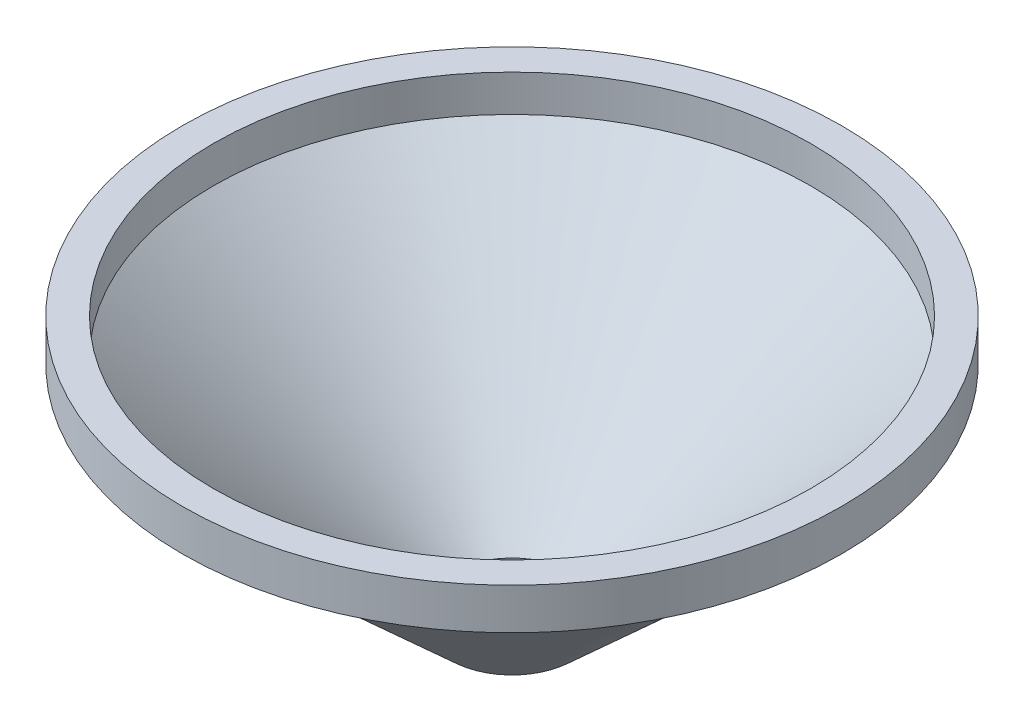
ISO-10303-21;
HEADER;
FILE_DESCRIPTION(('STEP AP214'),'2;1');
FILE_NAME('part.step','',(''),(''),'','','');
FILE_SCHEMA(('AUTOMOTIVE_DESIGN { 1 0 10303 214 1 1 1 1 }'));
ENDSEC;
DATA;
#1=APPLICATION_CONTEXT('core data for automotive mechanical design processes');
#2=APPLICATION_PROTOCOL_DEFINITION('international standard','automotive_design',2000,#1);
#3=PRODUCT_CONTEXT('',#1,'mechanical');
#4=PRODUCT('Part','Part','',(#3));
#5=PRODUCT_RELATED_PRODUCT_CATEGORY('part','',(#4));
#6=PRODUCT_DEFINITION_FORMATION('','',#4);
#7=PRODUCT_DEFINITION_CONTEXT('part definition',#1,'design');
#8=PRODUCT_DEFINITION('design','',#6,#7);
#9=PRODUCT_DEFINITION_SHAPE('','',#8);
#10=(LENGTH_UNIT() NAMED_UNIT(*) SI_UNIT(.MILLI.,.METRE.));
#11=(NAMED_UNIT(*) PLANE_ANGLE_UNIT() SI_UNIT($,.RADIAN.));
#12=(NAMED_UNIT(*) SI_UNIT($,.STERADIAN.) SOLID_ANGLE_UNIT());
#13=UNCERTAINTY_MEASURE_WITH_UNIT(LENGTH_MEASURE(1.E-05),#10,'distance_accuracy_value','');
#14=(GEOMETRIC_REPRESENTATION_CONTEXT(3) GLOBAL_UNCERTAINTY_ASSIGNED_CONTEXT((#13)) GLOBAL_UNIT_ASSIGNED_CONTEXT((#10,
#11,#12)) REPRESENTATION_CONTEXT('',''));
#15=CARTESIAN_POINT('',(0.,0.,0.));
#16=DIRECTION('',(0.,0.,1.));
#17=DIRECTION('',(1.,0.,0.));
#18=AXIS2_PLACEMENT_3D('',#15,#16,#17);
#19=CARTESIAN_POINT('',(14.5,0.,0.));
#20=DIRECTION('',(0.,1.,0.));
#21=DIRECTION('',(0.,0.,1.));
#22=AXIS2_PLACEMENT_3D('',#19,#20,#21);
#23=PLANE('',#22);
#24=CARTESIAN_POINT('',(0.,0.,0.));
#25=DIRECTION('',(0.,1.,0.));
#26=DIRECTION('',(0.,0.,1.));
#27=AXIS2_PLACEMENT_3D('',#24,#25,#26);
#28=CIRCLE('',#27,14.5);
#29=CARTESIAN_POINT('',(0.,0.,14.5));
#30=VERTEX_POINT('',#29);
#31=EDGE_CURVE('E40',#30,#30,#28,.T.);
#32=ORIENTED_EDGE('',*,*,#31,.F.);
#33=EDGE_LOOP('',(#32));
#34=FACE_BOUND('',#33,.T.);
#35=CARTESIAN_POINT('',(0.,0.,0.));
#36=DIRECTION('',(0.,1.,0.));
#37=DIRECTION('',(0.,0.,1.));
#38=AXIS2_PLACEMENT_3D('',#35,#36,#37);
#39=CIRCLE('',#38,16.);
#40=CARTESIAN_POINT('',(0.,0.,16.));
#41=VERTEX_POINT('',#40);
#42=EDGE_CURVE('E52',#41,#41,#39,.T.);
#43=ORIENTED_EDGE('',*,*,#42,.T.);
#44=EDGE_LOOP('',(#43));
#45=FACE_BOUND('',#44,.T.);
#46=ADVANCED_FACE('F32',(#34,#45),#23,.T.);
#47=CARTESIAN_POINT('',(0.,0.,0.));
#48=DIRECTION('',(0.,1.,0.));
#49=DIRECTION('',(0.,0.,1.));
#50=AXIS2_PLACEMENT_3D('',#47,#48,#49);
#51=CYLINDRICAL_SURFACE('',#50,14.5);
#52=CARTESIAN_POINT('',(0.,-1.7796105291498,0.));
#53=DIRECTION('',(0.,1.,0.));
#54=DIRECTION('',(0.,0.,1.));
#55=AXIS2_PLACEMENT_3D('',#52,#53,#54);
#56=CIRCLE('',#55,14.5);
#57=CARTESIAN_POINT('',(0.,-1.7796105291498,14.5));
#58=VERTEX_POINT('',#57);
#59=EDGE_CURVE('E44',#58,#58,#56,.T.);
#60=ORIENTED_EDGE('',*,*,#59,.F.);
#61=EDGE_LOOP('',(#60));
#62=FACE_BOUND('',#61,.T.);
#63=ORIENTED_EDGE('',*,*,#31,.T.);
#64=EDGE_LOOP('',(#63));
#65=FACE_BOUND('',#64,.T.);
#66=ADVANCED_FACE('F77',(#62,#65),#51,.F.);
#67=CARTESIAN_POINT('',(0.,-1.7796105291498,0.));
#68=DIRECTION('',(0.,1.,0.));
#69=DIRECTION('',(0.,0.,1.));
#70=AXIS2_PLACEMENT_3D('',#67,#68,#69);
#71=CONICAL_SURFACE('',#70,14.5,0.830318571532458);
#72=CARTESIAN_POINT('',(0.,-12.2902194260044,0.));
#73=DIRECTION('',(0.,1.,0.));
#74=DIRECTION('',(0.,0.,1.));
#75=AXIS2_PLACEMENT_3D('',#72,#73,#74);
#76=CIRCLE('',#75,3.);
#77=CARTESIAN_POINT('',(0.,-12.2902194260044,3.));
#78=VERTEX_POINT('',#77);
#79=EDGE_CURVE('E55',#78,#78,#76,.F.);
#80=ORIENTED_EDGE('',*,*,#79,.T.);
#81=EDGE_LOOP('',(#80));
#82=FACE_BOUND('',#81,.T.);
#83=ORIENTED_EDGE('',*,*,#59,.T.);
#84=EDGE_LOOP('',(#83));
#85=FACE_BOUND('',#84,.T.);
#86=ADVANCED_FACE('F82',(#82,#85),#71,.F.);
#87=CARTESIAN_POINT('',(-15.,-2.,0.));
#88=DIRECTION('',(0.,-1.,0.));
#89=DIRECTION('',(0.,0.,-1.));
#90=AXIS2_PLACEMENT_3D('',#87,#88,#89);
#91=PLANE('',#90);
#92=CARTESIAN_POINT('',(0.,-2.,0.));
#93=DIRECTION('',(0.,1.,0.));
#94=DIRECTION('',(0.,0.,1.));
#95=AXIS2_PLACEMENT_3D('',#92,#93,#94);
#96=CIRCLE('',#95,15.);
#97=CARTESIAN_POINT('',(0.,-2.,15.));
#98=VERTEX_POINT('',#97);
#99=EDGE_CURVE('E10',#98,#98,#96,.T.);
#100=ORIENTED_EDGE('',*,*,#99,.T.);
#101=EDGE_LOOP('',(#100));
#102=FACE_BOUND('',#101,.T.);
#103=CARTESIAN_POINT('',(0.,-2.,0.));
#104=DIRECTION('',(0.,1.,0.));
#105=DIRECTION('',(0.,0.,1.));
#106=AXIS2_PLACEMENT_3D('',#103,#104,#105);
#107=CIRCLE('',#106,16.);
#108=CARTESIAN_POINT('',(0.,-2.,16.));
#109=VERTEX_POINT('',#108);
#110=EDGE_CURVE('E49',#109,#109,#107,.T.);
#111=ORIENTED_EDGE('',*,*,#110,.F.);
#112=EDGE_LOOP('',(#111));
#113=FACE_BOUND('',#112,.T.);
#114=ADVANCED_FACE('F73',(#102,#113),#91,.T.);
#115=CARTESIAN_POINT('',(0.,0.,0.));
#116=DIRECTION('',(0.,1.,0.));
#117=DIRECTION('',(0.,0.,1.));
#118=AXIS2_PLACEMENT_3D('',#115,#116,#117);
#119=CYLINDRICAL_SURFACE('',#118,16.);
#120=ORIENTED_EDGE('',*,*,#110,.T.);
#121=EDGE_LOOP('',(#120));
#122=FACE_BOUND('',#121,.T.);
#123=ORIENTED_EDGE('',*,*,#42,.F.);
#124=EDGE_LOOP('',(#123));
#125=FACE_BOUND('',#124,.T.);
#126=ADVANCED_FACE('F67',(#122,#125),#119,.T.);
#127=CARTESIAN_POINT('',(0.,-2.,0.));
#128=DIRECTION('',(0.,1.,0.));
#129=DIRECTION('',(0.,0.,1.));
#130=AXIS2_PLACEMENT_3D('',#127,#128,#129);
#131=CONICAL_SURFACE('',#130,15.,0.830318571532458);
#132=CARTESIAN_POINT('',(0.,-12.96759189237,0.));
#133=DIRECTION('',(0.,1.,0.));
#134=DIRECTION('',(0.,0.,1.));
#135=AXIS2_PLACEMENT_3D('',#132,#133,#134);
#136=CIRCLE('',#135,3.);
#137=CARTESIAN_POINT('',(0.,-12.96759189237,3.));
#138=VERTEX_POINT('',#137);
#139=EDGE_CURVE('E36',#138,#138,#136,.F.);
#140=ORIENTED_EDGE('',*,*,#139,.F.);
#141=EDGE_LOOP('',(#140));
#142=FACE_BOUND('',#141,.T.);
#143=ORIENTED_EDGE('',*,*,#99,.F.);
#144=EDGE_LOOP('',(#143));
#145=FACE_BOUND('',#144,.T.);
#146=ADVANCED_FACE('F34',(#142,#145),#131,.T.);
#147=CARTESIAN_POINT('',(0.,-15.,0.));
#148=DIRECTION('',(0.,1.,0.));
#149=DIRECTION('',(0.,0.,1.));
#150=AXIS2_PLACEMENT_3D('',#147,#148,#149);
#151=CYLINDRICAL_SURFACE('',#150,3.);
#152=ORIENTED_EDGE('',*,*,#139,.T.);
#153=EDGE_LOOP('',(#152));
#154=FACE_BOUND('',#153,.T.);
#155=ORIENTED_EDGE('',*,*,#79,.F.);
#156=EDGE_LOOP('',(#155));
#157=FACE_BOUND('',#156,.T.);
#158=ADVANCED_FACE('F62',(#154,#157),#151,.F.);
#159=CLOSED_SHELL('',(#46,#66,#86,#114,#126,#146,#158));
#160=MANIFOLD_SOLID_BREP('B2',#159);
#161=ADVANCED_BREP_SHAPE_REPRESENTATION('',(#18,#160),#14);
#162=SHAPE_DEFINITION_REPRESENTATION(#9,#161);
ENDSEC;
END-ISO-10303-21;
